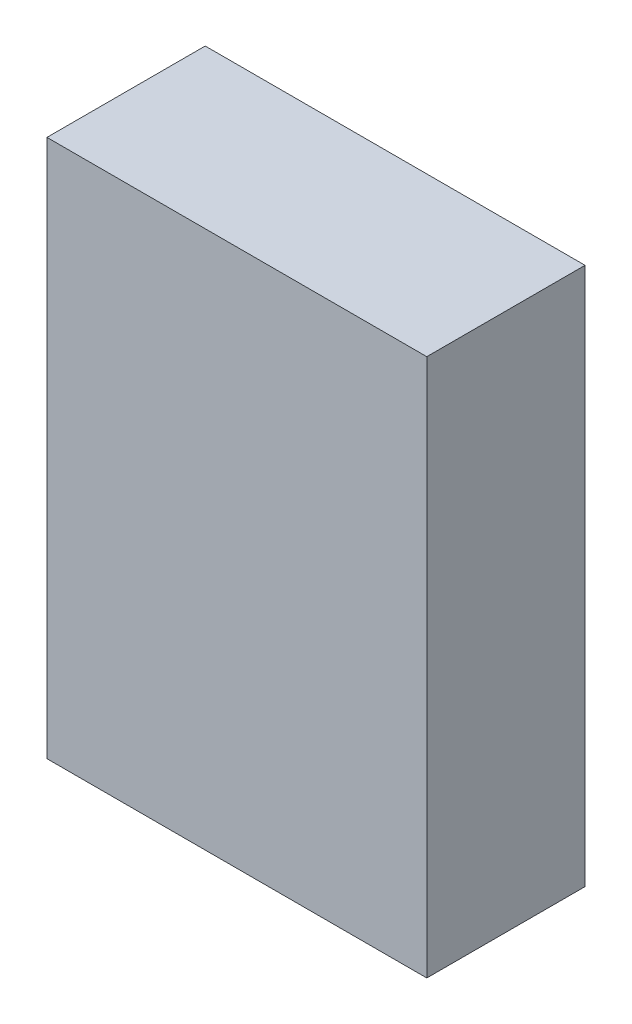
ISO-10303-21;
HEADER;
FILE_DESCRIPTION(('STEP AP214'),'2;1');
FILE_NAME('part.step','',(''),(''),'','','');
FILE_SCHEMA(('AUTOMOTIVE_DESIGN { 1 0 10303 214 1 1 1 1 }'));
ENDSEC;
DATA;
#1=APPLICATION_CONTEXT('core data for automotive mechanical design processes');
#2=APPLICATION_PROTOCOL_DEFINITION('international standard','automotive_design',2000,#1);
#3=PRODUCT_CONTEXT('',#1,'mechanical');
#4=PRODUCT('Part','Part','',(#3));
#5=PRODUCT_RELATED_PRODUCT_CATEGORY('part','',(#4));
#6=PRODUCT_DEFINITION_FORMATION('','',#4);
#7=PRODUCT_DEFINITION_CONTEXT('part definition',#1,'design');
#8=PRODUCT_DEFINITION('design','',#6,#7);
#9=PRODUCT_DEFINITION_SHAPE('','',#8);
#10=(LENGTH_UNIT() NAMED_UNIT(*) SI_UNIT(.MILLI.,.METRE.));
#11=(NAMED_UNIT(*) PLANE_ANGLE_UNIT() SI_UNIT($,.RADIAN.));
#12=(NAMED_UNIT(*) SI_UNIT($,.STERADIAN.) SOLID_ANGLE_UNIT());
#13=UNCERTAINTY_MEASURE_WITH_UNIT(LENGTH_MEASURE(1.E-05),#10,'distance_accuracy_value','');
#14=(GEOMETRIC_REPRESENTATION_CONTEXT(3) GLOBAL_UNCERTAINTY_ASSIGNED_CONTEXT((#13)) GLOBAL_UNIT_ASSIGNED_CONTEXT((#10,
#11,#12)) REPRESENTATION_CONTEXT('',''));
#15=CARTESIAN_POINT('',(0.,0.,0.));
#16=DIRECTION('',(0.,0.,1.));
#17=DIRECTION('',(1.,0.,0.));
#18=AXIS2_PLACEMENT_3D('',#15,#16,#17);
#19=CARTESIAN_POINT('',(1.13,-2.92,0.));
#20=DIRECTION('',(1.,0.,0.));
#21=DIRECTION('',(0.,0.,1.));
#22=AXIS2_PLACEMENT_3D('',#19,#20,#21);
#23=PLANE('',#22);
#24=DIRECTION('',(0.,1.,0.));
#25=VECTOR('',#24,1.);
#26=CARTESIAN_POINT('',(1.13,-2.92,0.1));
#27=LINE('',#26,#25);
#28=CARTESIAN_POINT('',(1.13,-2.92,0.1));
#29=VERTEX_POINT('',#28);
#30=CARTESIAN_POINT('',(1.13,-2.58,0.1));
#31=VERTEX_POINT('',#30);
#32=EDGE_CURVE('E11',#29,#31,#27,.T.);
#33=ORIENTED_EDGE('',*,*,#32,.T.);
#34=DIRECTION('',(0.,0.,1.));
#35=VECTOR('',#34,1.);
#36=CARTESIAN_POINT('',(1.13,-2.58,0.));
#37=LINE('',#36,#35);
#38=CARTESIAN_POINT('',(1.13,-2.58,0.));
#39=VERTEX_POINT('',#38);
#40=EDGE_CURVE('E24',#39,#31,#37,.T.);
#41=ORIENTED_EDGE('',*,*,#40,.F.);
#42=DIRECTION('',(0.,1.,0.));
#43=VECTOR('',#42,1.);
#44=CARTESIAN_POINT('',(1.13,-2.92,0.));
#45=LINE('',#44,#43);
#46=CARTESIAN_POINT('',(1.13,-2.92,0.));
#47=VERTEX_POINT('',#46);
#48=EDGE_CURVE('E86',#47,#39,#45,.T.);
#49=ORIENTED_EDGE('',*,*,#48,.F.);
#50=DIRECTION('',(0.,0.,1.));
#51=VECTOR('',#50,1.);
#52=CARTESIAN_POINT('',(1.13,-2.92,0.));
#53=LINE('',#52,#51);
#54=EDGE_CURVE('E36',#47,#29,#53,.T.);
#55=ORIENTED_EDGE('',*,*,#54,.T.);
#56=EDGE_LOOP('',(#33,#41,#49,#55));
#57=FACE_BOUND('',#56,.T.);
#58=ADVANCED_FACE('F17',(#57),#23,.F.);
#59=CARTESIAN_POINT('',(1.37,-2.92,0.));
#60=DIRECTION('',(1.,0.,0.));
#61=DIRECTION('',(0.,0.,1.));
#62=AXIS2_PLACEMENT_3D('',#59,#60,#61);
#63=PLANE('',#62);
#64=DIRECTION('',(0.,0.,1.));
#65=VECTOR('',#64,1.);
#66=CARTESIAN_POINT('',(1.37,-2.92,0.));
#67=LINE('',#66,#65);
#68=CARTESIAN_POINT('',(1.37,-2.92,0.));
#69=VERTEX_POINT('',#68);
#70=CARTESIAN_POINT('',(1.37,-2.92,0.1));
#71=VERTEX_POINT('',#70);
#72=EDGE_CURVE('E83',#69,#71,#67,.T.);
#73=ORIENTED_EDGE('',*,*,#72,.F.);
#74=DIRECTION('',(0.,1.,0.));
#75=VECTOR('',#74,1.);
#76=CARTESIAN_POINT('',(1.37,-2.92,0.));
#77=LINE('',#76,#75);
#78=CARTESIAN_POINT('',(1.37,-2.58,0.));
#79=VERTEX_POINT('',#78);
#80=EDGE_CURVE('E63',#69,#79,#77,.T.);
#81=ORIENTED_EDGE('',*,*,#80,.T.);
#82=DIRECTION('',(0.,0.,1.));
#83=VECTOR('',#82,1.);
#84=CARTESIAN_POINT('',(1.37,-2.58,0.));
#85=LINE('',#84,#83);
#86=CARTESIAN_POINT('',(1.37,-2.58,0.1));
#87=VERTEX_POINT('',#86);
#88=EDGE_CURVE('E57',#79,#87,#85,.T.);
#89=ORIENTED_EDGE('',*,*,#88,.T.);
#90=DIRECTION('',(0.,1.,0.));
#91=VECTOR('',#90,1.);
#92=CARTESIAN_POINT('',(1.37,-2.92,0.1));
#93=LINE('',#92,#91);
#94=EDGE_CURVE('E60',#71,#87,#93,.T.);
#95=ORIENTED_EDGE('',*,*,#94,.F.);
#96=EDGE_LOOP('',(#73,#81,#89,#95));
#97=FACE_BOUND('',#96,.T.);
#98=ADVANCED_FACE('F59',(#97),#63,.T.);
#99=CARTESIAN_POINT('',(1.13,-2.92,0.));
#100=DIRECTION('',(0.,1.,0.));
#101=DIRECTION('',(0.,0.,1.));
#102=AXIS2_PLACEMENT_3D('',#99,#100,#101);
#103=PLANE('',#102);
#104=ORIENTED_EDGE('',*,*,#72,.T.);
#105=DIRECTION('',(1.,0.,0.));
#106=VECTOR('',#105,1.);
#107=CARTESIAN_POINT('',(1.13,-2.92,0.1));
#108=LINE('',#107,#106);
#109=EDGE_CURVE('E71',#29,#71,#108,.T.);
#110=ORIENTED_EDGE('',*,*,#109,.F.);
#111=ORIENTED_EDGE('',*,*,#54,.F.);
#112=DIRECTION('',(1.,0.,0.));
#113=VECTOR('',#112,1.);
#114=CARTESIAN_POINT('',(1.13,-2.92,0.));
#115=LINE('',#114,#113);
#116=EDGE_CURVE('E76',#47,#69,#115,.T.);
#117=ORIENTED_EDGE('',*,*,#116,.T.);
#118=EDGE_LOOP('',(#104,#110,#111,#117));
#119=FACE_BOUND('',#118,.T.);
#120=ADVANCED_FACE('F91',(#119),#103,.F.);
#121=CARTESIAN_POINT('',(1.13,-2.58,0.));
#122=DIRECTION('',(0.,1.,0.));
#123=DIRECTION('',(0.,0.,1.));
#124=AXIS2_PLACEMENT_3D('',#121,#122,#123);
#125=PLANE('',#124);
#126=DIRECTION('',(1.,0.,0.));
#127=VECTOR('',#126,1.);
#128=CARTESIAN_POINT('',(1.13,-2.58,0.));
#129=LINE('',#128,#127);
#130=EDGE_CURVE('E74',#39,#79,#129,.T.);
#131=ORIENTED_EDGE('',*,*,#130,.F.);
#132=ORIENTED_EDGE('',*,*,#40,.T.);
#133=DIRECTION('',(1.,0.,0.));
#134=VECTOR('',#133,1.);
#135=CARTESIAN_POINT('',(1.13,-2.58,0.1));
#136=LINE('',#135,#134);
#137=EDGE_CURVE('E69',#31,#87,#136,.T.);
#138=ORIENTED_EDGE('',*,*,#137,.T.);
#139=ORIENTED_EDGE('',*,*,#88,.F.);
#140=EDGE_LOOP('',(#131,#132,#138,#139));
#141=FACE_BOUND('',#140,.T.);
#142=ADVANCED_FACE('F73',(#141),#125,.T.);
#143=CARTESIAN_POINT('',(1.13,-2.92,0.));
#144=DIRECTION('',(0.,0.,1.));
#145=DIRECTION('',(1.,0.,0.));
#146=AXIS2_PLACEMENT_3D('',#143,#144,#145);
#147=PLANE('',#146);
#148=ORIENTED_EDGE('',*,*,#130,.T.);
#149=ORIENTED_EDGE('',*,*,#80,.F.);
#150=ORIENTED_EDGE('',*,*,#116,.F.);
#151=ORIENTED_EDGE('',*,*,#48,.T.);
#152=EDGE_LOOP('',(#148,#149,#150,#151));
#153=FACE_BOUND('',#152,.T.);
#154=ADVANCED_FACE('F89',(#153),#147,.F.);
#155=CARTESIAN_POINT('',(1.13,-2.92,0.1));
#156=DIRECTION('',(0.,0.,1.));
#157=DIRECTION('',(1.,0.,0.));
#158=AXIS2_PLACEMENT_3D('',#155,#156,#157);
#159=PLANE('',#158);
#160=ORIENTED_EDGE('',*,*,#32,.F.);
#161=ORIENTED_EDGE('',*,*,#109,.T.);
#162=ORIENTED_EDGE('',*,*,#94,.T.);
#163=ORIENTED_EDGE('',*,*,#137,.F.);
#164=EDGE_LOOP('',(#160,#161,#162,#163));
#165=FACE_BOUND('',#164,.T.);
#166=ADVANCED_FACE('F68',(#165),#159,.T.);
#167=CLOSED_SHELL('',(#58,#98,#120,#142,#154,#166));
#168=MANIFOLD_SOLID_BREP('B1',#167);
#169=ADVANCED_BREP_SHAPE_REPRESENTATION('',(#18,#168),#14);
#170=SHAPE_DEFINITION_REPRESENTATION(#9,#169);
ENDSEC;
END-ISO-10303-21;
